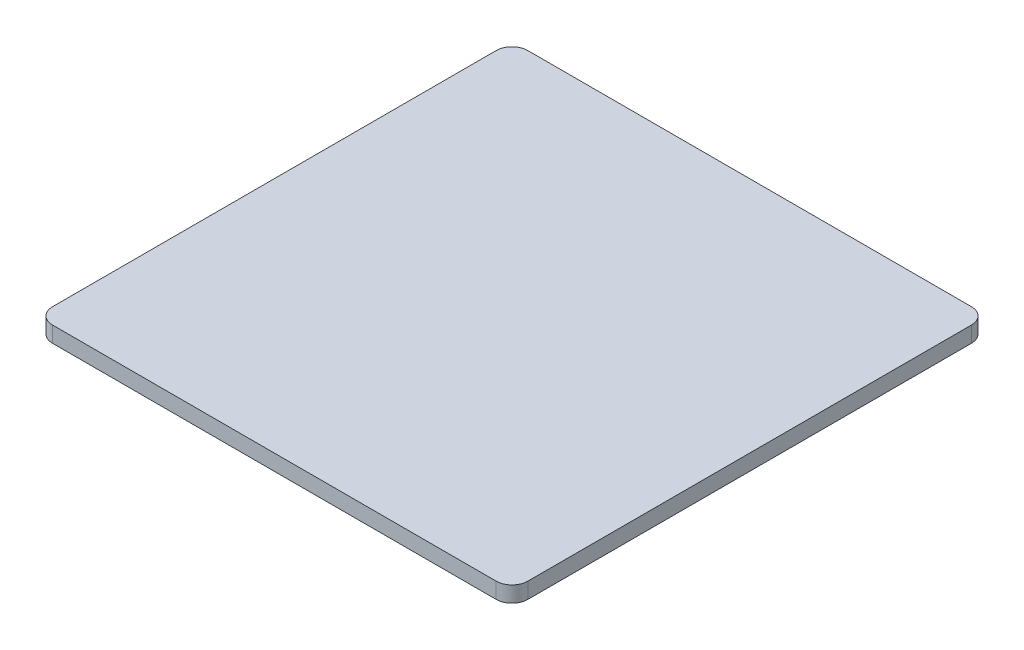
ISO-10303-21;
HEADER;
FILE_DESCRIPTION(('STEP AP214'),'2;1');
FILE_NAME('part.step','',(''),(''),'','','');
FILE_SCHEMA(('AUTOMOTIVE_DESIGN { 1 0 10303 214 1 1 1 1 }'));
ENDSEC;
DATA;
#1=APPLICATION_CONTEXT('core data for automotive mechanical design processes');
#2=APPLICATION_PROTOCOL_DEFINITION('international standard','automotive_design',2000,#1);
#3=PRODUCT_CONTEXT('',#1,'mechanical');
#4=PRODUCT('Part','Part','',(#3));
#5=PRODUCT_RELATED_PRODUCT_CATEGORY('part','',(#4));
#6=PRODUCT_DEFINITION_FORMATION('','',#4);
#7=PRODUCT_DEFINITION_CONTEXT('part definition',#1,'design');
#8=PRODUCT_DEFINITION('design','',#6,#7);
#9=PRODUCT_DEFINITION_SHAPE('','',#8);
#10=(LENGTH_UNIT() NAMED_UNIT(*) SI_UNIT(.MILLI.,.METRE.));
#11=(NAMED_UNIT(*) PLANE_ANGLE_UNIT() SI_UNIT($,.RADIAN.));
#12=(NAMED_UNIT(*) SI_UNIT($,.STERADIAN.) SOLID_ANGLE_UNIT());
#13=UNCERTAINTY_MEASURE_WITH_UNIT(LENGTH_MEASURE(1.E-05),#10,'distance_accuracy_value','');
#14=(GEOMETRIC_REPRESENTATION_CONTEXT(3) GLOBAL_UNCERTAINTY_ASSIGNED_CONTEXT((#13)) GLOBAL_UNIT_ASSIGNED_CONTEXT((#10,
#11,#12)) REPRESENTATION_CONTEXT('',''));
#15=CARTESIAN_POINT('',(0.,0.,0.));
#16=DIRECTION('',(0.,0.,1.));
#17=DIRECTION('',(1.,0.,0.));
#18=AXIS2_PLACEMENT_3D('',#15,#16,#17);
#19=CARTESIAN_POINT('',(-140.,10.,140.));
#20=DIRECTION('',(0.,-1.,0.));
#21=DIRECTION('',(0.,0.,-1.));
#22=AXIS2_PLACEMENT_3D('',#19,#20,#21);
#23=CYLINDRICAL_SURFACE('',#22,10.);
#24=CARTESIAN_POINT('',(-140.,0.,140.));
#25=DIRECTION('',(0.,1.,0.));
#26=DIRECTION('',(0.,0.,-1.));
#27=AXIS2_PLACEMENT_3D('',#24,#25,#26);
#28=CIRCLE('',#27,10.);
#29=CARTESIAN_POINT('',(-150.,0.,140.));
#30=VERTEX_POINT('',#29);
#31=CARTESIAN_POINT('',(-140.,0.,150.));
#32=VERTEX_POINT('',#31);
#33=EDGE_CURVE('E144',#30,#32,#28,.T.);
#34=ORIENTED_EDGE('',*,*,#33,.T.);
#35=DIRECTION('',(0.,-1.,0.));
#36=VECTOR('',#35,1.);
#37=CARTESIAN_POINT('',(-140.,10.,150.));
#38=LINE('',#37,#36);
#39=CARTESIAN_POINT('',(-140.,10.,150.));
#40=VERTEX_POINT('',#39);
#41=EDGE_CURVE('E11',#40,#32,#38,.T.);
#42=ORIENTED_EDGE('',*,*,#41,.F.);
#43=CARTESIAN_POINT('',(-140.,10.,140.));
#44=DIRECTION('',(0.,1.,0.));
#45=DIRECTION('',(0.,0.,-1.));
#46=AXIS2_PLACEMENT_3D('',#43,#44,#45);
#47=CIRCLE('',#46,10.);
#48=CARTESIAN_POINT('',(-150.,10.,140.));
#49=VERTEX_POINT('',#48);
#50=EDGE_CURVE('E166',#49,#40,#47,.T.);
#51=ORIENTED_EDGE('',*,*,#50,.F.);
#52=DIRECTION('',(0.,-1.,0.));
#53=VECTOR('',#52,1.);
#54=CARTESIAN_POINT('',(-150.,10.,140.));
#55=LINE('',#54,#53);
#56=EDGE_CURVE('E140',#49,#30,#55,.T.);
#57=ORIENTED_EDGE('',*,*,#56,.T.);
#58=EDGE_LOOP('',(#34,#42,#51,#57));
#59=FACE_BOUND('',#58,.T.);
#60=ADVANCED_FACE('F43',(#59),#23,.T.);
#61=CARTESIAN_POINT('',(140.,10.,150.));
#62=DIRECTION('',(0.,0.,-1.));
#63=DIRECTION('',(-1.,0.,0.));
#64=AXIS2_PLACEMENT_3D('',#61,#62,#63);
#65=PLANE('',#64);
#66=DIRECTION('',(1.,0.,0.));
#67=VECTOR('',#66,1.);
#68=CARTESIAN_POINT('',(140.,0.,150.));
#69=LINE('',#68,#67);
#70=CARTESIAN_POINT('',(140.,0.,150.));
#71=VERTEX_POINT('',#70);
#72=EDGE_CURVE('E148',#32,#71,#69,.T.);
#73=ORIENTED_EDGE('',*,*,#72,.T.);
#74=DIRECTION('',(0.,-1.,0.));
#75=VECTOR('',#74,1.);
#76=CARTESIAN_POINT('',(140.,10.,150.));
#77=LINE('',#76,#75);
#78=CARTESIAN_POINT('',(140.,10.,150.));
#79=VERTEX_POINT('',#78);
#80=EDGE_CURVE('E52',#79,#71,#77,.T.);
#81=ORIENTED_EDGE('',*,*,#80,.F.);
#82=DIRECTION('',(1.,0.,0.));
#83=VECTOR('',#82,1.);
#84=CARTESIAN_POINT('',(140.,10.,150.));
#85=LINE('',#84,#83);
#86=EDGE_CURVE('E103',#40,#79,#85,.T.);
#87=ORIENTED_EDGE('',*,*,#86,.F.);
#88=ORIENTED_EDGE('',*,*,#41,.T.);
#89=EDGE_LOOP('',(#73,#81,#87,#88));
#90=FACE_BOUND('',#89,.T.);
#91=ADVANCED_FACE('F212',(#90),#65,.F.);
#92=CARTESIAN_POINT('',(140.,10.,140.));
#93=DIRECTION('',(0.,-1.,0.));
#94=DIRECTION('',(0.,0.,-1.));
#95=AXIS2_PLACEMENT_3D('',#92,#93,#94);
#96=CYLINDRICAL_SURFACE('',#95,10.);
#97=CARTESIAN_POINT('',(140.,0.,140.));
#98=DIRECTION('',(0.,1.,0.));
#99=DIRECTION('',(0.,0.,-1.));
#100=AXIS2_PLACEMENT_3D('',#97,#98,#99);
#101=CIRCLE('',#100,10.);
#102=CARTESIAN_POINT('',(150.,0.,140.));
#103=VERTEX_POINT('',#102);
#104=EDGE_CURVE('E151',#71,#103,#101,.T.);
#105=ORIENTED_EDGE('',*,*,#104,.T.);
#106=DIRECTION('',(0.,-1.,0.));
#107=VECTOR('',#106,1.);
#108=CARTESIAN_POINT('',(150.,10.,140.));
#109=LINE('',#108,#107);
#110=CARTESIAN_POINT('',(150.,10.,140.));
#111=VERTEX_POINT('',#110);
#112=EDGE_CURVE('E177',#111,#103,#109,.T.);
#113=ORIENTED_EDGE('',*,*,#112,.F.);
#114=CARTESIAN_POINT('',(140.,10.,140.));
#115=DIRECTION('',(0.,1.,0.));
#116=DIRECTION('',(0.,0.,-1.));
#117=AXIS2_PLACEMENT_3D('',#114,#115,#116);
#118=CIRCLE('',#117,10.);
#119=EDGE_CURVE('E187',#79,#111,#118,.T.);
#120=ORIENTED_EDGE('',*,*,#119,.F.);
#121=ORIENTED_EDGE('',*,*,#80,.T.);
#122=EDGE_LOOP('',(#105,#113,#120,#121));
#123=FACE_BOUND('',#122,.T.);
#124=ADVANCED_FACE('F185',(#123),#96,.T.);
#125=CARTESIAN_POINT('',(150.,10.,-140.));
#126=DIRECTION('',(-1.,0.,0.));
#127=DIRECTION('',(0.,0.,1.));
#128=AXIS2_PLACEMENT_3D('',#125,#126,#127);
#129=PLANE('',#128);
#130=DIRECTION('',(0.,0.,-1.));
#131=VECTOR('',#130,1.);
#132=CARTESIAN_POINT('',(150.,0.,-140.));
#133=LINE('',#132,#131);
#134=CARTESIAN_POINT('',(150.,0.,-140.));
#135=VERTEX_POINT('',#134);
#136=EDGE_CURVE('E154',#103,#135,#133,.T.);
#137=ORIENTED_EDGE('',*,*,#136,.T.);
#138=DIRECTION('',(0.,-1.,0.));
#139=VECTOR('',#138,1.);
#140=CARTESIAN_POINT('',(150.,10.,-140.));
#141=LINE('',#140,#139);
#142=CARTESIAN_POINT('',(150.,10.,-140.));
#143=VERTEX_POINT('',#142);
#144=EDGE_CURVE('E173',#143,#135,#141,.T.);
#145=ORIENTED_EDGE('',*,*,#144,.F.);
#146=DIRECTION('',(0.,0.,-1.));
#147=VECTOR('',#146,1.);
#148=CARTESIAN_POINT('',(150.,10.,-140.));
#149=LINE('',#148,#147);
#150=EDGE_CURVE('E200',#111,#143,#149,.T.);
#151=ORIENTED_EDGE('',*,*,#150,.F.);
#152=ORIENTED_EDGE('',*,*,#112,.T.);
#153=EDGE_LOOP('',(#137,#145,#151,#152));
#154=FACE_BOUND('',#153,.T.);
#155=ADVANCED_FACE('F195',(#154),#129,.F.);
#156=CARTESIAN_POINT('',(140.,10.,-140.));
#157=DIRECTION('',(0.,-1.,0.));
#158=DIRECTION('',(0.,0.,-1.));
#159=AXIS2_PLACEMENT_3D('',#156,#157,#158);
#160=CYLINDRICAL_SURFACE('',#159,10.);
#161=CARTESIAN_POINT('',(140.,0.,-140.));
#162=DIRECTION('',(0.,1.,0.));
#163=DIRECTION('',(0.,0.,-1.));
#164=AXIS2_PLACEMENT_3D('',#161,#162,#163);
#165=CIRCLE('',#164,10.);
#166=CARTESIAN_POINT('',(140.,0.,-150.));
#167=VERTEX_POINT('',#166);
#168=EDGE_CURVE('E157',#135,#167,#165,.T.);
#169=ORIENTED_EDGE('',*,*,#168,.T.);
#170=DIRECTION('',(0.,-1.,0.));
#171=VECTOR('',#170,1.);
#172=CARTESIAN_POINT('',(140.,10.,-150.));
#173=LINE('',#172,#171);
#174=CARTESIAN_POINT('',(140.,10.,-150.));
#175=VERTEX_POINT('',#174);
#176=EDGE_CURVE('E133',#175,#167,#173,.T.);
#177=ORIENTED_EDGE('',*,*,#176,.F.);
#178=CARTESIAN_POINT('',(140.,10.,-140.));
#179=DIRECTION('',(0.,1.,0.));
#180=DIRECTION('',(0.,0.,-1.));
#181=AXIS2_PLACEMENT_3D('',#178,#179,#180);
#182=CIRCLE('',#181,10.);
#183=EDGE_CURVE('E122',#143,#175,#182,.T.);
#184=ORIENTED_EDGE('',*,*,#183,.F.);
#185=ORIENTED_EDGE('',*,*,#144,.T.);
#186=EDGE_LOOP('',(#169,#177,#184,#185));
#187=FACE_BOUND('',#186,.T.);
#188=ADVANCED_FACE('F198',(#187),#160,.T.);
#189=CARTESIAN_POINT('',(140.,10.,-150.));
#190=DIRECTION('',(0.,0.,1.));
#191=DIRECTION('',(1.,0.,0.));
#192=AXIS2_PLACEMENT_3D('',#189,#190,#191);
#193=PLANE('',#192);
#194=DIRECTION('',(-1.,0.,0.));
#195=VECTOR('',#194,1.);
#196=CARTESIAN_POINT('',(140.,0.,-150.));
#197=LINE('',#196,#195);
#198=CARTESIAN_POINT('',(-140.,0.,-150.));
#199=VERTEX_POINT('',#198);
#200=EDGE_CURVE('E131',#167,#199,#197,.T.);
#201=ORIENTED_EDGE('',*,*,#200,.T.);
#202=DIRECTION('',(0.,-1.,0.));
#203=VECTOR('',#202,1.);
#204=CARTESIAN_POINT('',(-140.,10.,-150.));
#205=LINE('',#204,#203);
#206=CARTESIAN_POINT('',(-140.,10.,-150.));
#207=VERTEX_POINT('',#206);
#208=EDGE_CURVE('E128',#207,#199,#205,.T.);
#209=ORIENTED_EDGE('',*,*,#208,.F.);
#210=DIRECTION('',(-1.,0.,0.));
#211=VECTOR('',#210,1.);
#212=CARTESIAN_POINT('',(140.,10.,-150.));
#213=LINE('',#212,#211);
#214=EDGE_CURVE('E116',#175,#207,#213,.T.);
#215=ORIENTED_EDGE('',*,*,#214,.F.);
#216=ORIENTED_EDGE('',*,*,#176,.T.);
#217=EDGE_LOOP('',(#201,#209,#215,#216));
#218=FACE_BOUND('',#217,.T.);
#219=ADVANCED_FACE('F129',(#218),#193,.F.);
#220=CARTESIAN_POINT('',(-140.,10.,-140.));
#221=DIRECTION('',(0.,-1.,0.));
#222=DIRECTION('',(0.,0.,-1.));
#223=AXIS2_PLACEMENT_3D('',#220,#221,#222);
#224=CYLINDRICAL_SURFACE('',#223,10.);
#225=CARTESIAN_POINT('',(-140.,0.,-140.));
#226=DIRECTION('',(0.,1.,0.));
#227=DIRECTION('',(0.,0.,1.));
#228=AXIS2_PLACEMENT_3D('',#225,#226,#227);
#229=CIRCLE('',#228,10.);
#230=CARTESIAN_POINT('',(-150.,0.,-140.));
#231=VERTEX_POINT('',#230);
#232=EDGE_CURVE('E89',#199,#231,#229,.T.);
#233=ORIENTED_EDGE('',*,*,#232,.T.);
#234=DIRECTION('',(0.,-1.,0.));
#235=VECTOR('',#234,1.);
#236=CARTESIAN_POINT('',(-150.,10.,-140.));
#237=LINE('',#236,#235);
#238=CARTESIAN_POINT('',(-150.,10.,-140.));
#239=VERTEX_POINT('',#238);
#240=EDGE_CURVE('E134',#239,#231,#237,.T.);
#241=ORIENTED_EDGE('',*,*,#240,.F.);
#242=CARTESIAN_POINT('',(-140.,10.,-140.));
#243=DIRECTION('',(0.,1.,0.));
#244=DIRECTION('',(0.,0.,1.));
#245=AXIS2_PLACEMENT_3D('',#242,#243,#244);
#246=CIRCLE('',#245,10.);
#247=EDGE_CURVE('E120',#207,#239,#246,.T.);
#248=ORIENTED_EDGE('',*,*,#247,.F.);
#249=ORIENTED_EDGE('',*,*,#208,.T.);
#250=EDGE_LOOP('',(#233,#241,#248,#249));
#251=FACE_BOUND('',#250,.T.);
#252=ADVANCED_FACE('F136',(#251),#224,.T.);
#253=CARTESIAN_POINT('',(-150.,10.,-140.));
#254=DIRECTION('',(1.,0.,0.));
#255=DIRECTION('',(0.,0.,-1.));
#256=AXIS2_PLACEMENT_3D('',#253,#254,#255);
#257=PLANE('',#256);
#258=DIRECTION('',(0.,0.,1.));
#259=VECTOR('',#258,1.);
#260=CARTESIAN_POINT('',(-150.,0.,-140.));
#261=LINE('',#260,#259);
#262=EDGE_CURVE('E95',#231,#30,#261,.T.);
#263=ORIENTED_EDGE('',*,*,#262,.T.);
#264=ORIENTED_EDGE('',*,*,#56,.F.);
#265=DIRECTION('',(0.,0.,1.));
#266=VECTOR('',#265,1.);
#267=CARTESIAN_POINT('',(-150.,10.,-140.));
#268=LINE('',#267,#266);
#269=EDGE_CURVE('E60',#239,#49,#268,.T.);
#270=ORIENTED_EDGE('',*,*,#269,.F.);
#271=ORIENTED_EDGE('',*,*,#240,.T.);
#272=EDGE_LOOP('',(#263,#264,#270,#271));
#273=FACE_BOUND('',#272,.T.);
#274=ADVANCED_FACE('F228',(#273),#257,.F.);
#275=CARTESIAN_POINT('',(-140.,10.,140.));
#276=DIRECTION('',(0.,-1.,0.));
#277=DIRECTION('',(0.,0.,-1.));
#278=AXIS2_PLACEMENT_3D('',#275,#276,#277);
#279=PLANE('',#278);
#280=ORIENTED_EDGE('',*,*,#50,.T.);
#281=ORIENTED_EDGE('',*,*,#86,.T.);
#282=ORIENTED_EDGE('',*,*,#119,.T.);
#283=ORIENTED_EDGE('',*,*,#150,.T.);
#284=ORIENTED_EDGE('',*,*,#183,.T.);
#285=ORIENTED_EDGE('',*,*,#214,.T.);
#286=ORIENTED_EDGE('',*,*,#247,.T.);
#287=ORIENTED_EDGE('',*,*,#269,.T.);
#288=EDGE_LOOP('',(#280,#281,#282,#283,#284,#285,#286,#287));
#289=FACE_BOUND('',#288,.T.);
#290=ADVANCED_FACE('F118',(#289),#279,.F.);
#291=CARTESIAN_POINT('',(-140.,0.,140.));
#292=DIRECTION('',(0.,-1.,0.));
#293=DIRECTION('',(0.,0.,-1.));
#294=AXIS2_PLACEMENT_3D('',#291,#292,#293);
#295=PLANE('',#294);
#296=ORIENTED_EDGE('',*,*,#33,.F.);
#297=ORIENTED_EDGE('',*,*,#262,.F.);
#298=ORIENTED_EDGE('',*,*,#232,.F.);
#299=ORIENTED_EDGE('',*,*,#200,.F.);
#300=ORIENTED_EDGE('',*,*,#168,.F.);
#301=ORIENTED_EDGE('',*,*,#136,.F.);
#302=ORIENTED_EDGE('',*,*,#104,.F.);
#303=ORIENTED_EDGE('',*,*,#72,.F.);
#304=EDGE_LOOP('',(#296,#297,#298,#299,#300,#301,#302,#303));
#305=FACE_BOUND('',#304,.T.);
#306=ADVANCED_FACE('F191',(#305),#295,.T.);
#307=CLOSED_SHELL('',(#60,#91,#124,#155,#188,#219,#252,#274,#290,#306));
#308=MANIFOLD_SOLID_BREP('B2',#307);
#309=ADVANCED_BREP_SHAPE_REPRESENTATION('',(#18,#308),#14);
#310=SHAPE_DEFINITION_REPRESENTATION(#9,#309);
ENDSEC;
END-ISO-10303-21;
